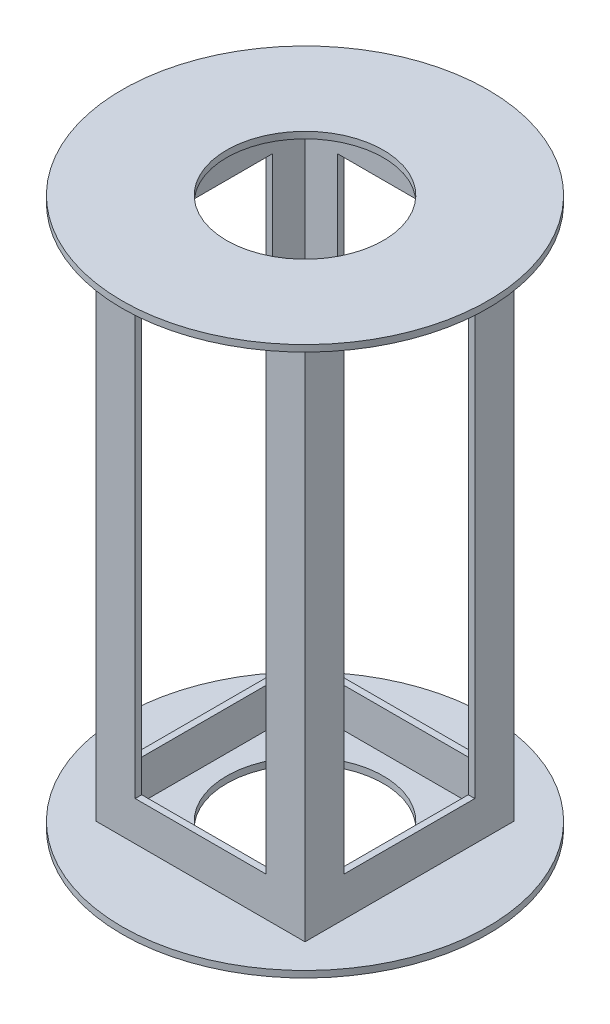
ISO-10303-21;
HEADER;
FILE_DESCRIPTION(('STEP AP214'),'2;1');
FILE_NAME('part.step','',(''),(''),'','','');
FILE_SCHEMA(('AUTOMOTIVE_DESIGN { 1 0 10303 214 1 1 1 1 }'));
ENDSEC;
DATA;
#1=APPLICATION_CONTEXT('core data for automotive mechanical design processes');
#2=APPLICATION_PROTOCOL_DEFINITION('international standard','automotive_design',2000,#1);
#3=PRODUCT_CONTEXT('',#1,'mechanical');
#4=PRODUCT('Part','Part','',(#3));
#5=PRODUCT_RELATED_PRODUCT_CATEGORY('part','',(#4));
#6=PRODUCT_DEFINITION_FORMATION('','',#4);
#7=PRODUCT_DEFINITION_CONTEXT('part definition',#1,'design');
#8=PRODUCT_DEFINITION('design','',#6,#7);
#9=PRODUCT_DEFINITION_SHAPE('','',#8);
#10=(LENGTH_UNIT() NAMED_UNIT(*) SI_UNIT(.MILLI.,.METRE.));
#11=(NAMED_UNIT(*) PLANE_ANGLE_UNIT() SI_UNIT($,.RADIAN.));
#12=(NAMED_UNIT(*) SI_UNIT($,.STERADIAN.) SOLID_ANGLE_UNIT());
#13=UNCERTAINTY_MEASURE_WITH_UNIT(LENGTH_MEASURE(1.E-05),#10,'distance_accuracy_value','');
#14=(GEOMETRIC_REPRESENTATION_CONTEXT(3) GLOBAL_UNCERTAINTY_ASSIGNED_CONTEXT((#13)) GLOBAL_UNIT_ASSIGNED_CONTEXT((#10,
#11,#12)) REPRESENTATION_CONTEXT('',''));
#15=CARTESIAN_POINT('',(0.,0.,0.));
#16=DIRECTION('',(0.,0.,1.));
#17=DIRECTION('',(1.,0.,0.));
#18=AXIS2_PLACEMENT_3D('',#15,#16,#17);
#19=CARTESIAN_POINT('',(0.,266.7,47.625));
#20=DIRECTION('',(0.,0.,-1.));
#21=DIRECTION('',(-1.,0.,0.));
#22=AXIS2_PLACEMENT_3D('',#19,#20,#21);
#23=PLANE('',#22);
#24=DIRECTION('',(0.,-1.,0.));
#25=VECTOR('',#24,1.);
#26=CARTESIAN_POINT('',(31.75,266.7,47.625));
#27=LINE('',#26,#25);
#28=CARTESIAN_POINT('',(31.75,244.475,47.625));
#29=VERTEX_POINT('',#28);
#30=CARTESIAN_POINT('',(31.75,22.225,47.625));
#31=VERTEX_POINT('',#30);
#32=EDGE_CURVE('E353',#29,#31,#27,.T.);
#33=ORIENTED_EDGE('',*,*,#32,.F.);
#34=DIRECTION('',(1.,0.,0.));
#35=VECTOR('',#34,1.);
#36=CARTESIAN_POINT('',(0.,244.475,47.625));
#37=LINE('',#36,#35);
#38=CARTESIAN_POINT('',(-31.75,244.475,47.625));
#39=VERTEX_POINT('',#38);
#40=EDGE_CURVE('E319',#39,#29,#37,.T.);
#41=ORIENTED_EDGE('',*,*,#40,.F.);
#42=DIRECTION('',(0.,1.,0.));
#43=VECTOR('',#42,1.);
#44=CARTESIAN_POINT('',(-31.75,266.7,47.625));
#45=LINE('',#44,#43);
#46=CARTESIAN_POINT('',(-31.75,22.225,47.625));
#47=VERTEX_POINT('',#46);
#48=EDGE_CURVE('E330',#47,#39,#45,.T.);
#49=ORIENTED_EDGE('',*,*,#48,.F.);
#50=DIRECTION('',(-1.,0.,0.));
#51=VECTOR('',#50,1.);
#52=CARTESIAN_POINT('',(0.,22.225,47.625));
#53=LINE('',#52,#51);
#54=EDGE_CURVE('E342',#31,#47,#53,.T.);
#55=ORIENTED_EDGE('',*,*,#54,.F.);
#56=EDGE_LOOP('',(#33,#41,#49,#55));
#57=FACE_BOUND('',#56,.T.);
#58=DIRECTION('',(0.,-1.,0.));
#59=VECTOR('',#58,1.);
#60=CARTESIAN_POINT('',(-47.625,266.7,47.625));
#61=LINE('',#60,#59);
#62=CARTESIAN_POINT('',(-47.625,263.525,47.625));
#63=VERTEX_POINT('',#62);
#64=CARTESIAN_POINT('',(-47.625,3.175,47.625));
#65=VERTEX_POINT('',#64);
#66=EDGE_CURVE('E407',#63,#65,#61,.T.);
#67=ORIENTED_EDGE('',*,*,#66,.F.);
#68=DIRECTION('',(1.,0.,0.));
#69=VECTOR('',#68,1.);
#70=CARTESIAN_POINT('',(0.,263.525,47.625));
#71=LINE('',#70,#69);
#72=CARTESIAN_POINT('',(47.625,263.525,47.625));
#73=VERTEX_POINT('',#72);
#74=EDGE_CURVE('E378',#63,#73,#71,.T.);
#75=ORIENTED_EDGE('',*,*,#74,.T.);
#76=DIRECTION('',(0.,-1.,0.));
#77=VECTOR('',#76,1.);
#78=CARTESIAN_POINT('',(47.625,266.7,47.625));
#79=LINE('',#78,#77);
#80=CARTESIAN_POINT('',(47.625,3.17499999999998,47.625));
#81=VERTEX_POINT('',#80);
#82=EDGE_CURVE('E397',#73,#81,#79,.T.);
#83=ORIENTED_EDGE('',*,*,#82,.T.);
#84=DIRECTION('',(-1.,0.,0.));
#85=VECTOR('',#84,1.);
#86=CARTESIAN_POINT('',(0.,3.175,47.625));
#87=LINE('',#86,#85);
#88=EDGE_CURVE('E448',#81,#65,#87,.T.);
#89=ORIENTED_EDGE('',*,*,#88,.T.);
#90=EDGE_LOOP('',(#67,#75,#83,#89));
#91=FACE_BOUND('',#90,.T.);
#92=ADVANCED_FACE('F79',(#57,#91),#23,.T.);
#93=CARTESIAN_POINT('',(-47.625,266.7,0.));
#94=DIRECTION('',(-1.,0.,0.));
#95=DIRECTION('',(0.,0.,1.));
#96=AXIS2_PLACEMENT_3D('',#93,#94,#95);
#97=PLANE('',#96);
#98=DIRECTION('',(0.,0.,-1.));
#99=VECTOR('',#98,1.);
#100=CARTESIAN_POINT('',(-47.625,244.475,0.));
#101=LINE('',#100,#99);
#102=CARTESIAN_POINT('',(-47.625,244.475,31.75));
#103=VERTEX_POINT('',#102);
#104=CARTESIAN_POINT('',(-47.625,244.475,-31.75));
#105=VERTEX_POINT('',#104);
#106=EDGE_CURVE('E238',#103,#105,#101,.T.);
#107=ORIENTED_EDGE('',*,*,#106,.T.);
#108=DIRECTION('',(0.,-1.,0.));
#109=VECTOR('',#108,1.);
#110=CARTESIAN_POINT('',(-47.625,266.7,-31.75));
#111=LINE('',#110,#109);
#112=CARTESIAN_POINT('',(-47.625,22.225,-31.75));
#113=VERTEX_POINT('',#112);
#114=EDGE_CURVE('E289',#105,#113,#111,.T.);
#115=ORIENTED_EDGE('',*,*,#114,.T.);
#116=DIRECTION('',(0.,0.,1.));
#117=VECTOR('',#116,1.);
#118=CARTESIAN_POINT('',(-47.625,22.225,0.));
#119=LINE('',#118,#117);
#120=CARTESIAN_POINT('',(-47.625,22.225,31.75));
#121=VERTEX_POINT('',#120);
#122=EDGE_CURVE('E264',#113,#121,#119,.T.);
#123=ORIENTED_EDGE('',*,*,#122,.T.);
#124=DIRECTION('',(0.,1.,0.));
#125=VECTOR('',#124,1.);
#126=CARTESIAN_POINT('',(-47.625,266.7,31.75));
#127=LINE('',#126,#125);
#128=EDGE_CURVE('E253',#121,#103,#127,.T.);
#129=ORIENTED_EDGE('',*,*,#128,.T.);
#130=EDGE_LOOP('',(#107,#115,#123,#129));
#131=FACE_BOUND('',#130,.T.);
#132=DIRECTION('',(0.,0.,-1.));
#133=VECTOR('',#132,1.);
#134=CARTESIAN_POINT('',(-47.625,263.525,0.));
#135=LINE('',#134,#133);
#136=CARTESIAN_POINT('',(-47.625,263.525,-47.625));
#137=VERTEX_POINT('',#136);
#138=EDGE_CURVE('E375',#63,#137,#135,.T.);
#139=ORIENTED_EDGE('',*,*,#138,.F.);
#140=ORIENTED_EDGE('',*,*,#66,.T.);
#141=DIRECTION('',(0.,0.,1.));
#142=VECTOR('',#141,1.);
#143=CARTESIAN_POINT('',(-47.625,3.175,0.));
#144=LINE('',#143,#142);
#145=CARTESIAN_POINT('',(-47.625,3.175,-47.625));
#146=VERTEX_POINT('',#145);
#147=EDGE_CURVE('E444',#146,#65,#144,.T.);
#148=ORIENTED_EDGE('',*,*,#147,.F.);
#149=DIRECTION('',(0.,-1.,0.));
#150=VECTOR('',#149,1.);
#151=CARTESIAN_POINT('',(-47.625,266.7,-47.625));
#152=LINE('',#151,#150);
#153=EDGE_CURVE('E404',#137,#146,#152,.T.);
#154=ORIENTED_EDGE('',*,*,#153,.F.);
#155=EDGE_LOOP('',(#139,#140,#148,#154));
#156=FACE_BOUND('',#155,.T.);
#157=ADVANCED_FACE('F262',(#131,#156),#97,.F.);
#158=CARTESIAN_POINT('',(0.,266.7,-47.625));
#159=DIRECTION('',(0.,0.,-1.));
#160=DIRECTION('',(-1.,0.,0.));
#161=AXIS2_PLACEMENT_3D('',#158,#159,#160);
#162=PLANE('',#161);
#163=DIRECTION('',(1.,0.,0.));
#164=VECTOR('',#163,1.);
#165=CARTESIAN_POINT('',(0.,244.475,-47.625));
#166=LINE('',#165,#164);
#167=CARTESIAN_POINT('',(-31.75,244.475,-47.625));
#168=VERTEX_POINT('',#167);
#169=CARTESIAN_POINT('',(31.75,244.475,-47.625));
#170=VERTEX_POINT('',#169);
#171=EDGE_CURVE('E315',#168,#170,#166,.T.);
#172=ORIENTED_EDGE('',*,*,#171,.T.);
#173=DIRECTION('',(0.,-1.,0.));
#174=VECTOR('',#173,1.);
#175=CARTESIAN_POINT('',(31.75,266.7,-47.625));
#176=LINE('',#175,#174);
#177=CARTESIAN_POINT('',(31.75,22.225,-47.625));
#178=VERTEX_POINT('',#177);
#179=EDGE_CURVE('E349',#170,#178,#176,.T.);
#180=ORIENTED_EDGE('',*,*,#179,.T.);
#181=DIRECTION('',(-1.,0.,0.));
#182=VECTOR('',#181,1.);
#183=CARTESIAN_POINT('',(0.,22.225,-47.625));
#184=LINE('',#183,#182);
#185=CARTESIAN_POINT('',(-31.75,22.225,-47.625));
#186=VERTEX_POINT('',#185);
#187=EDGE_CURVE('E338',#178,#186,#184,.T.);
#188=ORIENTED_EDGE('',*,*,#187,.T.);
#189=DIRECTION('',(0.,1.,0.));
#190=VECTOR('',#189,1.);
#191=CARTESIAN_POINT('',(-31.75,266.7,-47.625));
#192=LINE('',#191,#190);
#193=EDGE_CURVE('E326',#186,#168,#192,.T.);
#194=ORIENTED_EDGE('',*,*,#193,.T.);
#195=EDGE_LOOP('',(#172,#180,#188,#194));
#196=FACE_BOUND('',#195,.T.);
#197=DIRECTION('',(1.,0.,0.));
#198=VECTOR('',#197,1.);
#199=CARTESIAN_POINT('',(0.,263.525,-47.625));
#200=LINE('',#199,#198);
#201=CARTESIAN_POINT('',(47.625,263.525,-47.625));
#202=VERTEX_POINT('',#201);
#203=EDGE_CURVE('E369',#137,#202,#200,.T.);
#204=ORIENTED_EDGE('',*,*,#203,.F.);
#205=ORIENTED_EDGE('',*,*,#153,.T.);
#206=DIRECTION('',(-1.,0.,0.));
#207=VECTOR('',#206,1.);
#208=CARTESIAN_POINT('',(0.,3.175,-47.625));
#209=LINE('',#208,#207);
#210=CARTESIAN_POINT('',(47.625,3.175,-47.625));
#211=VERTEX_POINT('',#210);
#212=EDGE_CURVE('E440',#211,#146,#209,.T.);
#213=ORIENTED_EDGE('',*,*,#212,.F.);
#214=DIRECTION('',(0.,-1.,0.));
#215=VECTOR('',#214,1.);
#216=CARTESIAN_POINT('',(47.625,266.7,-47.625));
#217=LINE('',#216,#215);
#218=EDGE_CURVE('E400',#202,#211,#217,.T.);
#219=ORIENTED_EDGE('',*,*,#218,.F.);
#220=EDGE_LOOP('',(#204,#205,#213,#219));
#221=FACE_BOUND('',#220,.T.);
#222=ADVANCED_FACE('F584',(#196,#221),#162,.F.);
#223=CARTESIAN_POINT('',(0.,266.7,50.8));
#224=DIRECTION('',(0.,0.,-1.));
#225=DIRECTION('',(-1.,0.,0.));
#226=AXIS2_PLACEMENT_3D('',#223,#224,#225);
#227=PLANE('',#226);
#228=DIRECTION('',(1.,0.,0.));
#229=VECTOR('',#228,1.);
#230=CARTESIAN_POINT('',(0.,244.475,50.8));
#231=LINE('',#230,#229);
#232=CARTESIAN_POINT('',(-31.75,244.475,50.8));
#233=VERTEX_POINT('',#232);
#234=CARTESIAN_POINT('',(31.75,244.475,50.8));
#235=VERTEX_POINT('',#234);
#236=EDGE_CURVE('E311',#233,#235,#231,.T.);
#237=ORIENTED_EDGE('',*,*,#236,.T.);
#238=DIRECTION('',(0.,-1.,0.));
#239=VECTOR('',#238,1.);
#240=CARTESIAN_POINT('',(31.75,266.7,50.8));
#241=LINE('',#240,#239);
#242=CARTESIAN_POINT('',(31.75,22.225,50.8));
#243=VERTEX_POINT('',#242);
#244=EDGE_CURVE('E345',#235,#243,#241,.T.);
#245=ORIENTED_EDGE('',*,*,#244,.T.);
#246=DIRECTION('',(-1.,0.,0.));
#247=VECTOR('',#246,1.);
#248=CARTESIAN_POINT('',(0.,22.225,50.8));
#249=LINE('',#248,#247);
#250=CARTESIAN_POINT('',(-31.75,22.225,50.8));
#251=VERTEX_POINT('',#250);
#252=EDGE_CURVE('E334',#243,#251,#249,.T.);
#253=ORIENTED_EDGE('',*,*,#252,.T.);
#254=DIRECTION('',(0.,1.,0.));
#255=VECTOR('',#254,1.);
#256=CARTESIAN_POINT('',(-31.75,266.7,50.8));
#257=LINE('',#256,#255);
#258=EDGE_CURVE('E322',#251,#233,#257,.T.);
#259=ORIENTED_EDGE('',*,*,#258,.T.);
#260=EDGE_LOOP('',(#237,#245,#253,#259));
#261=FACE_BOUND('',#260,.T.);
#262=DIRECTION('',(1.,0.,0.));
#263=VECTOR('',#262,1.);
#264=CARTESIAN_POINT('',(0.,263.525,50.8));
#265=LINE('',#264,#263);
#266=CARTESIAN_POINT('',(-50.8,263.525,50.8));
#267=VERTEX_POINT('',#266);
#268=CARTESIAN_POINT('',(50.8,263.525,50.8));
#269=VERTEX_POINT('',#268);
#270=EDGE_CURVE('E393',#267,#269,#265,.T.);
#271=ORIENTED_EDGE('',*,*,#270,.F.);
#272=DIRECTION('',(0.,-1.,0.));
#273=VECTOR('',#272,1.);
#274=CARTESIAN_POINT('',(-50.8,266.7,50.8));
#275=LINE('',#274,#273);
#276=CARTESIAN_POINT('',(-50.8,3.17499999999998,50.8));
#277=VERTEX_POINT('',#276);
#278=EDGE_CURVE('E396',#267,#277,#275,.T.);
#279=ORIENTED_EDGE('',*,*,#278,.T.);
#280=DIRECTION('',(-1.,0.,0.));
#281=VECTOR('',#280,1.);
#282=CARTESIAN_POINT('',(0.,3.175,50.8));
#283=LINE('',#282,#281);
#284=CARTESIAN_POINT('',(50.8,3.175,50.8));
#285=VERTEX_POINT('',#284);
#286=EDGE_CURVE('E464',#285,#277,#283,.T.);
#287=ORIENTED_EDGE('',*,*,#286,.F.);
#288=DIRECTION('',(0.,-1.,0.));
#289=VECTOR('',#288,1.);
#290=CARTESIAN_POINT('',(50.8,266.7,50.8));
#291=LINE('',#290,#289);
#292=EDGE_CURVE('E401',#269,#285,#291,.T.);
#293=ORIENTED_EDGE('',*,*,#292,.F.);
#294=EDGE_LOOP('',(#271,#279,#287,#293));
#295=FACE_BOUND('',#294,.T.);
#296=ADVANCED_FACE('F537',(#261,#295),#227,.F.);
#297=CARTESIAN_POINT('',(50.8,266.7,0.));
#298=DIRECTION('',(-1.,0.,0.));
#299=DIRECTION('',(0.,0.,1.));
#300=AXIS2_PLACEMENT_3D('',#297,#298,#299);
#301=PLANE('',#300);
#302=DIRECTION('',(0.,0.,-1.));
#303=VECTOR('',#302,1.);
#304=CARTESIAN_POINT('',(50.8,244.475,0.));
#305=LINE('',#304,#303);
#306=CARTESIAN_POINT('',(50.8,244.475,31.75));
#307=VERTEX_POINT('',#306);
#308=CARTESIAN_POINT('',(50.8,244.475,-31.75));
#309=VERTEX_POINT('',#308);
#310=EDGE_CURVE('E248',#307,#309,#305,.T.);
#311=ORIENTED_EDGE('',*,*,#310,.T.);
#312=DIRECTION('',(0.,-1.,0.));
#313=VECTOR('',#312,1.);
#314=CARTESIAN_POINT('',(50.8,266.7,-31.75));
#315=LINE('',#314,#313);
#316=CARTESIAN_POINT('',(50.8,22.225,-31.75));
#317=VERTEX_POINT('',#316);
#318=EDGE_CURVE('E285',#309,#317,#315,.T.);
#319=ORIENTED_EDGE('',*,*,#318,.T.);
#320=DIRECTION('',(0.,0.,1.));
#321=VECTOR('',#320,1.);
#322=CARTESIAN_POINT('',(50.8,22.225,0.));
#323=LINE('',#322,#321);
#324=CARTESIAN_POINT('',(50.8,22.225,31.75));
#325=VERTEX_POINT('',#324);
#326=EDGE_CURVE('E271',#317,#325,#323,.T.);
#327=ORIENTED_EDGE('',*,*,#326,.T.);
#328=DIRECTION('',(0.,1.,0.));
#329=VECTOR('',#328,1.);
#330=CARTESIAN_POINT('',(50.8,266.7,31.75));
#331=LINE('',#330,#329);
#332=EDGE_CURVE('E267',#325,#307,#331,.T.);
#333=ORIENTED_EDGE('',*,*,#332,.T.);
#334=EDGE_LOOP('',(#311,#319,#327,#333));
#335=FACE_BOUND('',#334,.T.);
#336=DIRECTION('',(0.,0.,-1.));
#337=VECTOR('',#336,1.);
#338=CARTESIAN_POINT('',(50.8,263.525,0.));
#339=LINE('',#338,#337);
#340=CARTESIAN_POINT('',(50.8,263.525,-50.8));
#341=VERTEX_POINT('',#340);
#342=EDGE_CURVE('E390',#269,#341,#339,.T.);
#343=ORIENTED_EDGE('',*,*,#342,.F.);
#344=ORIENTED_EDGE('',*,*,#292,.T.);
#345=DIRECTION('',(0.,0.,1.));
#346=VECTOR('',#345,1.);
#347=CARTESIAN_POINT('',(50.8,3.175,0.));
#348=LINE('',#347,#346);
#349=CARTESIAN_POINT('',(50.8,3.175,-50.8));
#350=VERTEX_POINT('',#349);
#351=EDGE_CURVE('E460',#350,#285,#348,.T.);
#352=ORIENTED_EDGE('',*,*,#351,.F.);
#353=DIRECTION('',(0.,-1.,0.));
#354=VECTOR('',#353,1.);
#355=CARTESIAN_POINT('',(50.8,266.7,-50.8));
#356=LINE('',#355,#354);
#357=EDGE_CURVE('E416',#341,#350,#356,.T.);
#358=ORIENTED_EDGE('',*,*,#357,.F.);
#359=EDGE_LOOP('',(#343,#344,#352,#358));
#360=FACE_BOUND('',#359,.T.);
#361=ADVANCED_FACE('F533',(#335,#360),#301,.F.);
#362=CARTESIAN_POINT('',(0.,266.7,-50.8));
#363=DIRECTION('',(0.,0.,-1.));
#364=DIRECTION('',(-1.,0.,0.));
#365=AXIS2_PLACEMENT_3D('',#362,#363,#364);
#366=PLANE('',#365);
#367=DIRECTION('',(0.,-1.,0.));
#368=VECTOR('',#367,1.);
#369=CARTESIAN_POINT('',(31.75,266.7,-50.8));
#370=LINE('',#369,#368);
#371=CARTESIAN_POINT('',(31.75,244.475,-50.8));
#372=VERTEX_POINT('',#371);
#373=CARTESIAN_POINT('',(31.75,22.225,-50.8));
#374=VERTEX_POINT('',#373);
#375=EDGE_CURVE('E482',#372,#374,#370,.T.);
#376=ORIENTED_EDGE('',*,*,#375,.F.);
#377=DIRECTION('',(1.,0.,0.));
#378=VECTOR('',#377,1.);
#379=CARTESIAN_POINT('',(0.,244.475,-50.8));
#380=LINE('',#379,#378);
#381=CARTESIAN_POINT('',(-31.75,244.475,-50.8));
#382=VERTEX_POINT('',#381);
#383=EDGE_CURVE('E472',#382,#372,#380,.T.);
#384=ORIENTED_EDGE('',*,*,#383,.F.);
#385=DIRECTION('',(0.,1.,0.));
#386=VECTOR('',#385,1.);
#387=CARTESIAN_POINT('',(-31.75,266.7,-50.8));
#388=LINE('',#387,#386);
#389=CARTESIAN_POINT('',(-31.75,22.225,-50.8));
#390=VERTEX_POINT('',#389);
#391=EDGE_CURVE('E475',#390,#382,#388,.T.);
#392=ORIENTED_EDGE('',*,*,#391,.F.);
#393=DIRECTION('',(-1.,0.,0.));
#394=VECTOR('',#393,1.);
#395=CARTESIAN_POINT('',(0.,22.225,-50.8));
#396=LINE('',#395,#394);
#397=EDGE_CURVE('E479',#374,#390,#396,.T.);
#398=ORIENTED_EDGE('',*,*,#397,.F.);
#399=EDGE_LOOP('',(#376,#384,#392,#398));
#400=FACE_BOUND('',#399,.T.);
#401=DIRECTION('',(0.,-1.,0.));
#402=VECTOR('',#401,1.);
#403=CARTESIAN_POINT('',(-50.8,266.7,-50.8));
#404=LINE('',#403,#402);
#405=CARTESIAN_POINT('',(-50.8,263.525,-50.8));
#406=VERTEX_POINT('',#405);
#407=CARTESIAN_POINT('',(-50.8,3.175,-50.8));
#408=VERTEX_POINT('',#407);
#409=EDGE_CURVE('E413',#406,#408,#404,.T.);
#410=ORIENTED_EDGE('',*,*,#409,.F.);
#411=DIRECTION('',(1.,0.,0.));
#412=VECTOR('',#411,1.);
#413=CARTESIAN_POINT('',(0.,263.525,-50.8));
#414=LINE('',#413,#412);
#415=EDGE_CURVE('E386',#406,#341,#414,.T.);
#416=ORIENTED_EDGE('',*,*,#415,.T.);
#417=ORIENTED_EDGE('',*,*,#357,.T.);
#418=DIRECTION('',(-1.,0.,0.));
#419=VECTOR('',#418,1.);
#420=CARTESIAN_POINT('',(0.,3.175,-50.8));
#421=LINE('',#420,#419);
#422=EDGE_CURVE('E456',#350,#408,#421,.T.);
#423=ORIENTED_EDGE('',*,*,#422,.T.);
#424=EDGE_LOOP('',(#410,#416,#417,#423));
#425=FACE_BOUND('',#424,.T.);
#426=ADVANCED_FACE('F536',(#400,#425),#366,.T.);
#427=CARTESIAN_POINT('',(-50.8,266.7,0.));
#428=DIRECTION('',(-1.,0.,0.));
#429=DIRECTION('',(0.,0.,1.));
#430=AXIS2_PLACEMENT_3D('',#427,#428,#429);
#431=PLANE('',#430);
#432=DIRECTION('',(0.,-1.,0.));
#433=VECTOR('',#432,1.);
#434=CARTESIAN_POINT('',(-50.8,266.7,-31.75));
#435=LINE('',#434,#433);
#436=CARTESIAN_POINT('',(-50.8,244.475,-31.75));
#437=VERTEX_POINT('',#436);
#438=CARTESIAN_POINT('',(-50.8,22.225,-31.75));
#439=VERTEX_POINT('',#438);
#440=EDGE_CURVE('E282',#437,#439,#435,.T.);
#441=ORIENTED_EDGE('',*,*,#440,.F.);
#442=DIRECTION('',(0.,0.,-1.));
#443=VECTOR('',#442,1.);
#444=CARTESIAN_POINT('',(-50.8,244.475,0.));
#445=LINE('',#444,#443);
#446=CARTESIAN_POINT('',(-50.8,244.475,31.75));
#447=VERTEX_POINT('',#446);
#448=EDGE_CURVE('E520',#447,#437,#445,.T.);
#449=ORIENTED_EDGE('',*,*,#448,.F.);
#450=DIRECTION('',(0.,1.,0.));
#451=VECTOR('',#450,1.);
#452=CARTESIAN_POINT('',(-50.8,266.7,31.75));
#453=LINE('',#452,#451);
#454=CARTESIAN_POINT('',(-50.8,22.225,31.75));
#455=VERTEX_POINT('',#454);
#456=EDGE_CURVE('E247',#455,#447,#453,.T.);
#457=ORIENTED_EDGE('',*,*,#456,.F.);
#458=DIRECTION('',(0.,0.,1.));
#459=VECTOR('',#458,1.);
#460=CARTESIAN_POINT('',(-50.8,22.225,0.));
#461=LINE('',#460,#459);
#462=EDGE_CURVE('E266',#439,#455,#461,.T.);
#463=ORIENTED_EDGE('',*,*,#462,.F.);
#464=EDGE_LOOP('',(#441,#449,#457,#463));
#465=FACE_BOUND('',#464,.T.);
#466=ORIENTED_EDGE('',*,*,#278,.F.);
#467=DIRECTION('',(0.,0.,-1.));
#468=VECTOR('',#467,1.);
#469=CARTESIAN_POINT('',(-50.8,263.525,0.));
#470=LINE('',#469,#468);
#471=EDGE_CURVE('E382',#267,#406,#470,.T.);
#472=ORIENTED_EDGE('',*,*,#471,.T.);
#473=ORIENTED_EDGE('',*,*,#409,.T.);
#474=DIRECTION('',(0.,0.,1.));
#475=VECTOR('',#474,1.);
#476=CARTESIAN_POINT('',(-50.8,3.175,0.));
#477=LINE('',#476,#475);
#478=EDGE_CURVE('E452',#408,#277,#477,.T.);
#479=ORIENTED_EDGE('',*,*,#478,.T.);
#480=EDGE_LOOP('',(#466,#472,#473,#479));
#481=FACE_BOUND('',#480,.T.);
#482=ADVANCED_FACE('F553',(#465,#481),#431,.T.);
#483=CARTESIAN_POINT('',(47.625,266.7,0.));
#484=DIRECTION('',(-1.,0.,0.));
#485=DIRECTION('',(0.,0.,1.));
#486=AXIS2_PLACEMENT_3D('',#483,#484,#485);
#487=PLANE('',#486);
#488=DIRECTION('',(0.,-1.,0.));
#489=VECTOR('',#488,1.);
#490=CARTESIAN_POINT('',(47.625,266.7,-31.75));
#491=LINE('',#490,#489);
#492=CARTESIAN_POINT('',(47.625,244.475,-31.75));
#493=VERTEX_POINT('',#492);
#494=CARTESIAN_POINT('',(47.625,22.225,-31.75));
#495=VERTEX_POINT('',#494);
#496=EDGE_CURVE('E12',#493,#495,#491,.T.);
#497=ORIENTED_EDGE('',*,*,#496,.F.);
#498=DIRECTION('',(0.,0.,-1.));
#499=VECTOR('',#498,1.);
#500=CARTESIAN_POINT('',(47.625,244.475,0.));
#501=LINE('',#500,#499);
#502=CARTESIAN_POINT('',(47.625,244.475,31.75));
#503=VERTEX_POINT('',#502);
#504=EDGE_CURVE('E485',#503,#493,#501,.T.);
#505=ORIENTED_EDGE('',*,*,#504,.F.);
#506=DIRECTION('',(0.,1.,0.));
#507=VECTOR('',#506,1.);
#508=CARTESIAN_POINT('',(47.625,266.7,31.75));
#509=LINE('',#508,#507);
#510=CARTESIAN_POINT('',(47.625,22.225,31.75));
#511=VERTEX_POINT('',#510);
#512=EDGE_CURVE('E488',#511,#503,#509,.T.);
#513=ORIENTED_EDGE('',*,*,#512,.F.);
#514=DIRECTION('',(0.,0.,1.));
#515=VECTOR('',#514,1.);
#516=CARTESIAN_POINT('',(47.625,22.225,0.));
#517=LINE('',#516,#515);
#518=EDGE_CURVE('E88',#495,#511,#517,.T.);
#519=ORIENTED_EDGE('',*,*,#518,.F.);
#520=EDGE_LOOP('',(#497,#505,#513,#519));
#521=FACE_BOUND('',#520,.T.);
#522=ORIENTED_EDGE('',*,*,#82,.F.);
#523=DIRECTION('',(0.,0.,-1.));
#524=VECTOR('',#523,1.);
#525=CARTESIAN_POINT('',(47.625,263.525,0.));
#526=LINE('',#525,#524);
#527=EDGE_CURVE('E468',#73,#202,#526,.T.);
#528=ORIENTED_EDGE('',*,*,#527,.T.);
#529=ORIENTED_EDGE('',*,*,#218,.T.);
#530=DIRECTION('',(0.,0.,1.));
#531=VECTOR('',#530,1.);
#532=CARTESIAN_POINT('',(47.625,3.175,0.));
#533=LINE('',#532,#531);
#534=EDGE_CURVE('E425',#211,#81,#533,.T.);
#535=ORIENTED_EDGE('',*,*,#534,.T.);
#536=EDGE_LOOP('',(#522,#528,#529,#535));
#537=FACE_BOUND('',#536,.T.);
#538=ADVANCED_FACE('F510',(#521,#537),#487,.T.);
#539=CARTESIAN_POINT('',(0.,3.175,0.));
#540=DIRECTION('',(0.,1.,0.));
#541=DIRECTION('',(0.,0.,1.));
#542=AXIS2_PLACEMENT_3D('',#539,#540,#541);
#543=PLANE('',#542);
#544=CARTESIAN_POINT('',(0.,3.175,0.));
#545=DIRECTION('',(0.,1.,0.));
#546=DIRECTION('',(0.,0.,1.));
#547=AXIS2_PLACEMENT_3D('',#544,#545,#546);
#548=CIRCLE('',#547,88.9);
#549=CARTESIAN_POINT('',(0.,3.175,88.9));
#550=VERTEX_POINT('',#549);
#551=EDGE_CURVE('E421',#550,#550,#548,.T.);
#552=ORIENTED_EDGE('',*,*,#551,.T.);
#553=EDGE_LOOP('',(#552));
#554=FACE_BOUND('',#553,.T.);
#555=ORIENTED_EDGE('',*,*,#351,.T.);
#556=ORIENTED_EDGE('',*,*,#286,.T.);
#557=ORIENTED_EDGE('',*,*,#478,.F.);
#558=ORIENTED_EDGE('',*,*,#422,.F.);
#559=EDGE_LOOP('',(#555,#556,#557,#558));
#560=FACE_BOUND('',#559,.T.);
#561=ADVANCED_FACE('F550',(#554,#560),#543,.T.);
#562=CARTESIAN_POINT('',(0.,3.175,0.));
#563=DIRECTION('',(0.,-1.,0.));
#564=DIRECTION('',(0.,0.,-1.));
#565=AXIS2_PLACEMENT_3D('',#562,#563,#564);
#566=CYLINDRICAL_SURFACE('',#565,88.9);
#567=ORIENTED_EDGE('',*,*,#551,.F.);
#568=EDGE_LOOP('',(#567));
#569=FACE_BOUND('',#568,.T.);
#570=CARTESIAN_POINT('',(0.,0.,0.));
#571=DIRECTION('',(0.,1.,0.));
#572=DIRECTION('',(0.,0.,1.));
#573=AXIS2_PLACEMENT_3D('',#570,#571,#572);
#574=CIRCLE('',#573,88.9);
#575=CARTESIAN_POINT('',(0.,0.,88.9));
#576=VERTEX_POINT('',#575);
#577=EDGE_CURVE('E426',#576,#576,#574,.T.);
#578=ORIENTED_EDGE('',*,*,#577,.T.);
#579=EDGE_LOOP('',(#578));
#580=FACE_BOUND('',#579,.T.);
#581=ADVANCED_FACE('F604',(#569,#580),#566,.T.);
#582=CARTESIAN_POINT('',(0.,0.,0.));
#583=DIRECTION('',(0.,1.,0.));
#584=DIRECTION('',(0.,0.,1.));
#585=AXIS2_PLACEMENT_3D('',#582,#583,#584);
#586=PLANE('',#585);
#587=CARTESIAN_POINT('',(0.,0.,0.));
#588=DIRECTION('',(0.,1.,0.));
#589=DIRECTION('',(0.,0.,1.));
#590=AXIS2_PLACEMENT_3D('',#587,#588,#589);
#591=CIRCLE('',#590,38.1);
#592=CARTESIAN_POINT('',(0.,0.,38.1));
#593=VERTEX_POINT('',#592);
#594=EDGE_CURVE('E410',#593,#593,#591,.T.);
#595=ORIENTED_EDGE('',*,*,#594,.T.);
#596=EDGE_LOOP('',(#595));
#597=FACE_BOUND('',#596,.T.);
#598=ORIENTED_EDGE('',*,*,#577,.F.);
#599=EDGE_LOOP('',(#598));
#600=FACE_BOUND('',#599,.T.);
#601=ADVANCED_FACE('F601',(#597,#600),#586,.F.);
#602=ORIENTED_EDGE('',*,*,#88,.F.);
#603=ORIENTED_EDGE('',*,*,#534,.F.);
#604=ORIENTED_EDGE('',*,*,#212,.T.);
#605=ORIENTED_EDGE('',*,*,#147,.T.);
#606=EDGE_LOOP('',(#602,#603,#604,#605));
#607=FACE_BOUND('',#606,.T.);
#608=CARTESIAN_POINT('',(0.,3.175,0.));
#609=DIRECTION('',(0.,1.,0.));
#610=DIRECTION('',(0.,0.,1.));
#611=AXIS2_PLACEMENT_3D('',#608,#609,#610);
#612=CIRCLE('',#611,38.1);
#613=CARTESIAN_POINT('',(0.,3.175,38.1));
#614=VERTEX_POINT('',#613);
#615=EDGE_CURVE('E430',#614,#614,#612,.T.);
#616=ORIENTED_EDGE('',*,*,#615,.F.);
#617=EDGE_LOOP('',(#616));
#618=FACE_BOUND('',#617,.T.);
#619=ADVANCED_FACE('F577',(#607,#618),#543,.T.);
#620=CARTESIAN_POINT('',(0.,3.175,0.));
#621=DIRECTION('',(0.,-1.,0.));
#622=DIRECTION('',(0.,0.,-1.));
#623=AXIS2_PLACEMENT_3D('',#620,#621,#622);
#624=CYLINDRICAL_SURFACE('',#623,38.1);
#625=ORIENTED_EDGE('',*,*,#615,.T.);
#626=EDGE_LOOP('',(#625));
#627=FACE_BOUND('',#626,.T.);
#628=ORIENTED_EDGE('',*,*,#594,.F.);
#629=EDGE_LOOP('',(#628));
#630=FACE_BOUND('',#629,.T.);
#631=ADVANCED_FACE('F81',(#627,#630),#624,.F.);
#632=CARTESIAN_POINT('',(0.,263.525,0.));
#633=DIRECTION('',(0.,1.,0.));
#634=DIRECTION('',(0.,0.,1.));
#635=AXIS2_PLACEMENT_3D('',#632,#633,#634);
#636=PLANE('',#635);
#637=ORIENTED_EDGE('',*,*,#74,.F.);
#638=ORIENTED_EDGE('',*,*,#138,.T.);
#639=ORIENTED_EDGE('',*,*,#203,.T.);
#640=ORIENTED_EDGE('',*,*,#527,.F.);
#641=EDGE_LOOP('',(#637,#638,#639,#640));
#642=FACE_BOUND('',#641,.T.);
#643=CARTESIAN_POINT('',(0.,263.525,0.));
#644=DIRECTION('',(0.,1.,0.));
#645=DIRECTION('',(0.,0.,1.));
#646=AXIS2_PLACEMENT_3D('',#643,#644,#645);
#647=CIRCLE('',#646,38.1);
#648=CARTESIAN_POINT('',(0.,263.525,38.1));
#649=VERTEX_POINT('',#648);
#650=EDGE_CURVE('E357',#649,#649,#647,.T.);
#651=ORIENTED_EDGE('',*,*,#650,.T.);
#652=EDGE_LOOP('',(#651));
#653=FACE_BOUND('',#652,.T.);
#654=ADVANCED_FACE('F562',(#642,#653),#636,.F.);
#655=CARTESIAN_POINT('',(0.,263.525,0.));
#656=DIRECTION('',(0.,1.,0.));
#657=DIRECTION('',(0.,0.,1.));
#658=AXIS2_PLACEMENT_3D('',#655,#656,#657);
#659=CYLINDRICAL_SURFACE('',#658,38.1);
#660=ORIENTED_EDGE('',*,*,#650,.F.);
#661=EDGE_LOOP('',(#660));
#662=FACE_BOUND('',#661,.T.);
#663=CARTESIAN_POINT('',(0.,266.7,0.));
#664=DIRECTION('',(0.,1.,0.));
#665=DIRECTION('',(0.,0.,1.));
#666=AXIS2_PLACEMENT_3D('',#663,#664,#665);
#667=CIRCLE('',#666,38.1);
#668=CARTESIAN_POINT('',(0.,266.7,38.1));
#669=VERTEX_POINT('',#668);
#670=EDGE_CURVE('E356',#669,#669,#667,.T.);
#671=ORIENTED_EDGE('',*,*,#670,.T.);
#672=EDGE_LOOP('',(#671));
#673=FACE_BOUND('',#672,.T.);
#674=ADVANCED_FACE('F570',(#662,#673),#659,.F.);
#675=CARTESIAN_POINT('',(0.,266.7,0.));
#676=DIRECTION('',(0.,1.,0.));
#677=DIRECTION('',(0.,0.,1.));
#678=AXIS2_PLACEMENT_3D('',#675,#676,#677);
#679=PLANE('',#678);
#680=ORIENTED_EDGE('',*,*,#670,.F.);
#681=EDGE_LOOP('',(#680));
#682=FACE_BOUND('',#681,.T.);
#683=CARTESIAN_POINT('',(0.,266.7,0.));
#684=DIRECTION('',(0.,1.,0.));
#685=DIRECTION('',(0.,0.,1.));
#686=AXIS2_PLACEMENT_3D('',#683,#684,#685);
#687=CIRCLE('',#686,88.9);
#688=CARTESIAN_POINT('',(0.,266.7,88.9));
#689=VERTEX_POINT('',#688);
#690=EDGE_CURVE('E361',#689,#689,#687,.T.);
#691=ORIENTED_EDGE('',*,*,#690,.T.);
#692=EDGE_LOOP('',(#691));
#693=FACE_BOUND('',#692,.T.);
#694=ADVANCED_FACE('F559',(#682,#693),#679,.T.);
#695=CARTESIAN_POINT('',(0.,263.525,0.));
#696=DIRECTION('',(0.,1.,0.));
#697=DIRECTION('',(0.,0.,1.));
#698=AXIS2_PLACEMENT_3D('',#695,#696,#697);
#699=CIRCLE('',#698,88.9);
#700=CARTESIAN_POINT('',(0.,263.525,88.9));
#701=VERTEX_POINT('',#700);
#702=EDGE_CURVE('E365',#701,#701,#699,.T.);
#703=ORIENTED_EDGE('',*,*,#702,.F.);
#704=EDGE_LOOP('',(#703));
#705=FACE_BOUND('',#704,.T.);
#706=ORIENTED_EDGE('',*,*,#471,.F.);
#707=ORIENTED_EDGE('',*,*,#270,.T.);
#708=ORIENTED_EDGE('',*,*,#342,.T.);
#709=ORIENTED_EDGE('',*,*,#415,.F.);
#710=EDGE_LOOP('',(#706,#707,#708,#709));
#711=FACE_BOUND('',#710,.T.);
#712=ADVANCED_FACE('F556',(#705,#711),#636,.F.);
#713=CARTESIAN_POINT('',(0.,263.525,0.));
#714=DIRECTION('',(0.,1.,0.));
#715=DIRECTION('',(0.,0.,1.));
#716=AXIS2_PLACEMENT_3D('',#713,#714,#715);
#717=CYLINDRICAL_SURFACE('',#716,88.9);
#718=ORIENTED_EDGE('',*,*,#702,.T.);
#719=EDGE_LOOP('',(#718));
#720=FACE_BOUND('',#719,.T.);
#721=ORIENTED_EDGE('',*,*,#690,.F.);
#722=EDGE_LOOP('',(#721));
#723=FACE_BOUND('',#722,.T.);
#724=ADVANCED_FACE('F558',(#720,#723),#717,.T.);
#725=CARTESIAN_POINT('',(31.75,244.475,-88.9));
#726=DIRECTION('',(0.,1.,0.));
#727=DIRECTION('',(0.,0.,1.));
#728=AXIS2_PLACEMENT_3D('',#725,#726,#727);
#729=PLANE('',#728);
#730=DIRECTION('',(0.,0.,1.));
#731=VECTOR('',#730,1.);
#732=CARTESIAN_POINT('',(-31.75,244.475,-88.9));
#733=LINE('',#732,#731);
#734=EDGE_CURVE('E303',#382,#168,#733,.T.);
#735=ORIENTED_EDGE('',*,*,#734,.F.);
#736=ORIENTED_EDGE('',*,*,#383,.T.);
#737=DIRECTION('',(0.,0.,1.));
#738=VECTOR('',#737,1.);
#739=CARTESIAN_POINT('',(31.75,244.475,-88.9));
#740=LINE('',#739,#738);
#741=EDGE_CURVE('E308',#372,#170,#740,.T.);
#742=ORIENTED_EDGE('',*,*,#741,.T.);
#743=ORIENTED_EDGE('',*,*,#171,.F.);
#744=EDGE_LOOP('',(#735,#736,#742,#743));
#745=FACE_BOUND('',#744,.T.);
#746=ADVANCED_FACE('F567',(#745),#729,.F.);
#747=CARTESIAN_POINT('',(-31.75,244.475,-88.9));
#748=DIRECTION('',(-1.,0.,0.));
#749=DIRECTION('',(0.,0.,1.));
#750=AXIS2_PLACEMENT_3D('',#747,#748,#749);
#751=PLANE('',#750);
#752=DIRECTION('',(0.,0.,1.));
#753=VECTOR('',#752,1.);
#754=CARTESIAN_POINT('',(-31.75,22.225,-88.9));
#755=LINE('',#754,#753);
#756=EDGE_CURVE('E298',#390,#186,#755,.T.);
#757=ORIENTED_EDGE('',*,*,#756,.F.);
#758=ORIENTED_EDGE('',*,*,#391,.T.);
#759=ORIENTED_EDGE('',*,*,#734,.T.);
#760=ORIENTED_EDGE('',*,*,#193,.F.);
#761=EDGE_LOOP('',(#757,#758,#759,#760));
#762=FACE_BOUND('',#761,.T.);
#763=ADVANCED_FACE('F688',(#762),#751,.F.);
#764=CARTESIAN_POINT('',(-31.75,22.225,-88.9));
#765=DIRECTION('',(0.,-1.,0.));
#766=DIRECTION('',(1.,0.,0.));
#767=AXIS2_PLACEMENT_3D('',#764,#765,#766);
#768=PLANE('',#767);
#769=DIRECTION('',(0.,0.,1.));
#770=VECTOR('',#769,1.);
#771=CARTESIAN_POINT('',(31.75,22.225,-88.9));
#772=LINE('',#771,#770);
#773=EDGE_CURVE('E297',#374,#178,#772,.T.);
#774=ORIENTED_EDGE('',*,*,#773,.F.);
#775=ORIENTED_EDGE('',*,*,#397,.T.);
#776=ORIENTED_EDGE('',*,*,#756,.T.);
#777=ORIENTED_EDGE('',*,*,#187,.F.);
#778=EDGE_LOOP('',(#774,#775,#776,#777));
#779=FACE_BOUND('',#778,.T.);
#780=ADVANCED_FACE('F699',(#779),#768,.F.);
#781=CARTESIAN_POINT('',(31.75,22.225,-88.9));
#782=DIRECTION('',(1.,0.,0.));
#783=DIRECTION('',(0.,0.,-1.));
#784=AXIS2_PLACEMENT_3D('',#781,#782,#783);
#785=PLANE('',#784);
#786=ORIENTED_EDGE('',*,*,#741,.F.);
#787=ORIENTED_EDGE('',*,*,#375,.T.);
#788=ORIENTED_EDGE('',*,*,#773,.T.);
#789=ORIENTED_EDGE('',*,*,#179,.F.);
#790=EDGE_LOOP('',(#786,#787,#788,#789));
#791=FACE_BOUND('',#790,.T.);
#792=ADVANCED_FACE('F710',(#791),#785,.F.);
#793=ORIENTED_EDGE('',*,*,#32,.T.);
#794=EDGE_CURVE('E293',#31,#243,#772,.T.);
#795=ORIENTED_EDGE('',*,*,#794,.T.);
#796=ORIENTED_EDGE('',*,*,#244,.F.);
#797=EDGE_CURVE('E292',#29,#235,#740,.T.);
#798=ORIENTED_EDGE('',*,*,#797,.F.);
#799=EDGE_LOOP('',(#793,#795,#796,#798));
#800=FACE_BOUND('',#799,.T.);
#801=ADVANCED_FACE('F721',(#800),#785,.F.);
#802=ORIENTED_EDGE('',*,*,#54,.T.);
#803=EDGE_CURVE('E299',#47,#251,#755,.T.);
#804=ORIENTED_EDGE('',*,*,#803,.T.);
#805=ORIENTED_EDGE('',*,*,#252,.F.);
#806=ORIENTED_EDGE('',*,*,#794,.F.);
#807=EDGE_LOOP('',(#802,#804,#805,#806));
#808=FACE_BOUND('',#807,.T.);
#809=ADVANCED_FACE('F713',(#808),#768,.F.);
#810=ORIENTED_EDGE('',*,*,#48,.T.);
#811=EDGE_CURVE('E304',#39,#233,#733,.T.);
#812=ORIENTED_EDGE('',*,*,#811,.T.);
#813=ORIENTED_EDGE('',*,*,#258,.F.);
#814=ORIENTED_EDGE('',*,*,#803,.F.);
#815=EDGE_LOOP('',(#810,#812,#813,#814));
#816=FACE_BOUND('',#815,.T.);
#817=ADVANCED_FACE('F702',(#816),#751,.F.);
#818=ORIENTED_EDGE('',*,*,#40,.T.);
#819=ORIENTED_EDGE('',*,*,#797,.T.);
#820=ORIENTED_EDGE('',*,*,#236,.F.);
#821=ORIENTED_EDGE('',*,*,#811,.F.);
#822=EDGE_LOOP('',(#818,#819,#820,#821));
#823=FACE_BOUND('',#822,.T.);
#824=ADVANCED_FACE('F691',(#823),#729,.F.);
#825=CARTESIAN_POINT('',(-88.9,244.475,-31.75));
#826=DIRECTION('',(0.,1.,0.));
#827=DIRECTION('',(0.,0.,1.));
#828=AXIS2_PLACEMENT_3D('',#825,#826,#827);
#829=PLANE('',#828);
#830=DIRECTION('',(1.,0.,0.));
#831=VECTOR('',#830,1.);
#832=CARTESIAN_POINT('',(-88.9,244.475,31.75));
#833=LINE('',#832,#831);
#834=EDGE_CURVE('E259',#503,#307,#833,.T.);
#835=ORIENTED_EDGE('',*,*,#834,.F.);
#836=ORIENTED_EDGE('',*,*,#504,.T.);
#837=DIRECTION('',(1.,0.,0.));
#838=VECTOR('',#837,1.);
#839=CARTESIAN_POINT('',(-88.9,244.475,-31.75));
#840=LINE('',#839,#838);
#841=EDGE_CURVE('E103',#493,#309,#840,.T.);
#842=ORIENTED_EDGE('',*,*,#841,.T.);
#843=ORIENTED_EDGE('',*,*,#310,.F.);
#844=EDGE_LOOP('',(#835,#836,#842,#843));
#845=FACE_BOUND('',#844,.T.);
#846=ADVANCED_FACE('F512',(#845),#829,.F.);
#847=CARTESIAN_POINT('',(-88.9,244.475,31.75));
#848=DIRECTION('',(0.,0.,1.));
#849=DIRECTION('',(1.,0.,0.));
#850=AXIS2_PLACEMENT_3D('',#847,#848,#849);
#851=PLANE('',#850);
#852=DIRECTION('',(1.,0.,0.));
#853=VECTOR('',#852,1.);
#854=CARTESIAN_POINT('',(-88.9,22.225,31.75));
#855=LINE('',#854,#853);
#856=EDGE_CURVE('E258',#511,#325,#855,.T.);
#857=ORIENTED_EDGE('',*,*,#856,.F.);
#858=ORIENTED_EDGE('',*,*,#512,.T.);
#859=ORIENTED_EDGE('',*,*,#834,.T.);
#860=ORIENTED_EDGE('',*,*,#332,.F.);
#861=EDGE_LOOP('',(#857,#858,#859,#860));
#862=FACE_BOUND('',#861,.T.);
#863=ADVANCED_FACE('F504',(#862),#851,.F.);
#864=CARTESIAN_POINT('',(-88.9,22.225,31.75));
#865=DIRECTION('',(0.,-1.,0.));
#866=DIRECTION('',(0.,0.,-1.));
#867=AXIS2_PLACEMENT_3D('',#864,#865,#866);
#868=PLANE('',#867);
#869=DIRECTION('',(1.,0.,0.));
#870=VECTOR('',#869,1.);
#871=CARTESIAN_POINT('',(-88.9,22.225,-31.75));
#872=LINE('',#871,#870);
#873=EDGE_CURVE('E499',#495,#317,#872,.T.);
#874=ORIENTED_EDGE('',*,*,#873,.F.);
#875=ORIENTED_EDGE('',*,*,#518,.T.);
#876=ORIENTED_EDGE('',*,*,#856,.T.);
#877=ORIENTED_EDGE('',*,*,#326,.F.);
#878=EDGE_LOOP('',(#874,#875,#876,#877));
#879=FACE_BOUND('',#878,.T.);
#880=ADVANCED_FACE('F497',(#879),#868,.F.);
#881=CARTESIAN_POINT('',(-88.9,22.225,-31.75));
#882=DIRECTION('',(0.,0.,-1.));
#883=DIRECTION('',(-1.,0.,0.));
#884=AXIS2_PLACEMENT_3D('',#881,#882,#883);
#885=PLANE('',#884);
#886=ORIENTED_EDGE('',*,*,#841,.F.);
#887=ORIENTED_EDGE('',*,*,#496,.T.);
#888=ORIENTED_EDGE('',*,*,#873,.T.);
#889=ORIENTED_EDGE('',*,*,#318,.F.);
#890=EDGE_LOOP('',(#886,#887,#888,#889));
#891=FACE_BOUND('',#890,.T.);
#892=ADVANCED_FACE('F514',(#891),#885,.F.);
#893=EDGE_CURVE('E95',#437,#105,#840,.T.);
#894=ORIENTED_EDGE('',*,*,#893,.F.);
#895=ORIENTED_EDGE('',*,*,#440,.T.);
#896=EDGE_CURVE('E523',#439,#113,#872,.T.);
#897=ORIENTED_EDGE('',*,*,#896,.T.);
#898=ORIENTED_EDGE('',*,*,#114,.F.);
#899=EDGE_LOOP('',(#894,#895,#897,#898));
#900=FACE_BOUND('',#899,.T.);
#901=ADVANCED_FACE('F811',(#900),#885,.F.);
#902=ORIENTED_EDGE('',*,*,#896,.F.);
#903=ORIENTED_EDGE('',*,*,#462,.T.);
#904=EDGE_CURVE('E508',#455,#121,#855,.T.);
#905=ORIENTED_EDGE('',*,*,#904,.T.);
#906=ORIENTED_EDGE('',*,*,#122,.F.);
#907=EDGE_LOOP('',(#902,#903,#905,#906));
#908=FACE_BOUND('',#907,.T.);
#909=ADVANCED_FACE('F803',(#908),#868,.F.);
#910=ORIENTED_EDGE('',*,*,#904,.F.);
#911=ORIENTED_EDGE('',*,*,#456,.T.);
#912=EDGE_CURVE('E241',#447,#103,#833,.T.);
#913=ORIENTED_EDGE('',*,*,#912,.T.);
#914=ORIENTED_EDGE('',*,*,#128,.F.);
#915=EDGE_LOOP('',(#910,#911,#913,#914));
#916=FACE_BOUND('',#915,.T.);
#917=ADVANCED_FACE('F252',(#916),#851,.F.);
#918=ORIENTED_EDGE('',*,*,#912,.F.);
#919=ORIENTED_EDGE('',*,*,#448,.T.);
#920=ORIENTED_EDGE('',*,*,#893,.T.);
#921=ORIENTED_EDGE('',*,*,#106,.F.);
#922=EDGE_LOOP('',(#918,#919,#920,#921));
#923=FACE_BOUND('',#922,.T.);
#924=ADVANCED_FACE('F240',(#923),#829,.F.);
#925=CLOSED_SHELL('',(#92,#157,#222,#296,#361,#426,#482,#538,#561,#581,#601,#619,#631,#654,#674,
#694,#712,#724,#746,#763,#780,#792,#801,#809,#817,#824,#846,#863,#880,#892,#901,#909,#917,#924));
#926=MANIFOLD_SOLID_BREP('B2',#925);
#927=ADVANCED_BREP_SHAPE_REPRESENTATION('',(#18,#926),#14);
#928=SHAPE_DEFINITION_REPRESENTATION(#9,#927);
ENDSEC;
END-ISO-10303-21;
